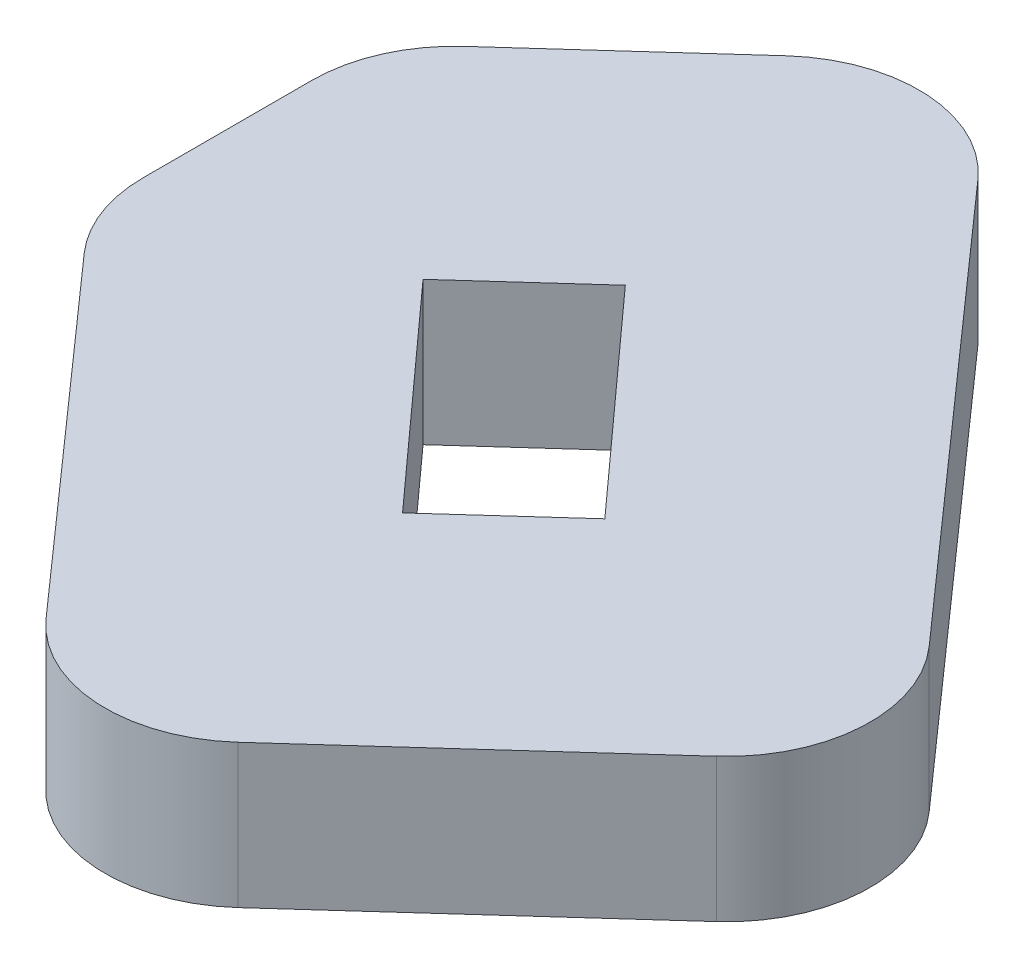
ISO-10303-21;
HEADER;
FILE_DESCRIPTION(('STEP AP214'),'2;1');
FILE_NAME('part.step','',(''),(''),'','','');
FILE_SCHEMA(('AUTOMOTIVE_DESIGN { 1 0 10303 214 1 1 1 1 }'));
ENDSEC;
DATA;
#1=APPLICATION_CONTEXT('core data for automotive mechanical design processes');
#2=APPLICATION_PROTOCOL_DEFINITION('international standard','automotive_design',2000,#1);
#3=PRODUCT_CONTEXT('',#1,'mechanical');
#4=PRODUCT('Part','Part','',(#3));
#5=PRODUCT_RELATED_PRODUCT_CATEGORY('part','',(#4));
#6=PRODUCT_DEFINITION_FORMATION('','',#4);
#7=PRODUCT_DEFINITION_CONTEXT('part definition',#1,'design');
#8=PRODUCT_DEFINITION('design','',#6,#7);
#9=PRODUCT_DEFINITION_SHAPE('','',#8);
#10=(LENGTH_UNIT() NAMED_UNIT(*) SI_UNIT(.MILLI.,.METRE.));
#11=(NAMED_UNIT(*) PLANE_ANGLE_UNIT() SI_UNIT($,.RADIAN.));
#12=(NAMED_UNIT(*) SI_UNIT($,.STERADIAN.) SOLID_ANGLE_UNIT());
#13=UNCERTAINTY_MEASURE_WITH_UNIT(LENGTH_MEASURE(1.E-05),#10,'distance_accuracy_value','');
#14=(GEOMETRIC_REPRESENTATION_CONTEXT(3) GLOBAL_UNCERTAINTY_ASSIGNED_CONTEXT((#13)) GLOBAL_UNIT_ASSIGNED_CONTEXT((#10,
#11,#12)) REPRESENTATION_CONTEXT('',''));
#15=CARTESIAN_POINT('',(0.,0.,0.));
#16=DIRECTION('',(0.,0.,1.));
#17=DIRECTION('',(1.,0.,0.));
#18=AXIS2_PLACEMENT_3D('',#15,#16,#17);
#19=CARTESIAN_POINT('',(0.,0.,0.));
#20=DIRECTION('',(0.,1.,0.));
#21=DIRECTION('',(0.,0.,1.));
#22=AXIS2_PLACEMENT_3D('',#19,#20,#21);
#23=PLANE('',#22);
#24=DIRECTION('',(0.741997771412981,0.,-0.670402347264812));
#25=VECTOR('',#24,1.);
#26=CARTESIAN_POINT('',(-134.548077407903,0.,-58.5644233707118));
#27=LINE('',#26,#25);
#28=CARTESIAN_POINT('',(-136.90392033214,0.,-56.435895918146));
#29=VERTEX_POINT('',#28);
#30=CARTESIAN_POINT('',(-134.548077407903,0.,-58.5644233707118));
#31=VERTEX_POINT('',#30);
#32=EDGE_CURVE('E136',#29,#31,#27,.T.);
#33=ORIENTED_EDGE('',*,*,#32,.T.);
#34=DIRECTION('',(0.670402347264813,0.,0.74199777141298));
#35=VECTOR('',#34,1.);
#36=CARTESIAN_POINT('',(-130.291022502772,0.,-53.8527375222393));
#37=LINE('',#36,#35);
#38=CARTESIAN_POINT('',(-130.291022502772,0.,-53.8527375222393));
#39=VERTEX_POINT('',#38);
#40=EDGE_CURVE('E145',#31,#39,#37,.T.);
#41=ORIENTED_EDGE('',*,*,#40,.T.);
#42=DIRECTION('',(-0.741997771412981,0.,0.670402347264812));
#43=VECTOR('',#42,1.);
#44=CARTESIAN_POINT('',(-132.646865427008,0.,-51.7242100696736));
#45=LINE('',#44,#43);
#46=CARTESIAN_POINT('',(-132.646865427008,0.,-51.7242100696736));
#47=VERTEX_POINT('',#46);
#48=EDGE_CURVE('E48',#39,#47,#45,.T.);
#49=ORIENTED_EDGE('',*,*,#48,.T.);
#50=DIRECTION('',(-0.670402347264813,0.,-0.74199777141298));
#51=VECTOR('',#50,1.);
#52=CARTESIAN_POINT('',(-136.90392033214,0.,-56.435895918146));
#53=LINE('',#52,#51);
#54=EDGE_CURVE('E142',#47,#29,#53,.T.);
#55=ORIENTED_EDGE('',*,*,#54,.T.);
#56=EDGE_LOOP('',(#33,#41,#49,#55));
#57=FACE_BOUND('',#56,.T.);
#58=DIRECTION('',(0.74199777141298,0.,-0.670402347264814));
#59=VECTOR('',#58,1.);
#60=CARTESIAN_POINT('',(-132.445850386458,0.,-43.3484393677768));
#61=LINE('',#60,#59);
#62=CARTESIAN_POINT('',(-130.06736181069,0.,-45.4974273911521));
#63=VERTEX_POINT('',#62);
#64=CARTESIAN_POINT('',(-124.492221590851,0.,-50.5346218864851));
#65=VERTEX_POINT('',#64);
#66=EDGE_CURVE('E166',#63,#65,#61,.T.);
#67=ORIENTED_EDGE('',*,*,#66,.T.);
#68=CARTESIAN_POINT('',(-126.620749043416,0.,-52.8904648107213));
#69=DIRECTION('',(0.,1.,0.));
#70=DIRECTION('',(0.,0.,1.));
#71=AXIS2_PLACEMENT_3D('',#68,#69,#70);
#72=CIRCLE('',#71,3.175);
#73=CARTESIAN_POINT('',(-124.244651682958,0.,-54.9963580496165));
#74=VERTEX_POINT('',#73);
#75=EDGE_CURVE('E212',#65,#74,#72,.T.);
#76=ORIENTED_EDGE('',*,*,#75,.T.);
#77=DIRECTION('',(0.66327346106935,0.,0.748377121404099));
#78=VECTOR('',#77,1.);
#79=CARTESIAN_POINT('',(-122.15880870831,0.,-52.6428835738676));
#80=LINE('',#79,#78);
#81=CARTESIAN_POINT('',(-132.668031904426,0.,-64.5005300278993));
#82=VERTEX_POINT('',#81);
#83=EDGE_CURVE('E174',#82,#74,#80,.T.);
#84=ORIENTED_EDGE('',*,*,#83,.F.);
#85=CARTESIAN_POINT('',(-135.044129264884,0.,-62.3946367890041));
#86=DIRECTION('',(0.,1.,0.));
#87=DIRECTION('',(0.,0.,1.));
#88=AXIS2_PLACEMENT_3D('',#85,#86,#87);
#89=CIRCLE('',#88,3.175);
#90=CARTESIAN_POINT('',(-137.172656717449,0.,-64.7504797132403));
#91=VERTEX_POINT('',#90);
#92=EDGE_CURVE('E204',#82,#91,#89,.T.);
#93=ORIENTED_EDGE('',*,*,#92,.T.);
#94=DIRECTION('',(0.741997771412981,0.,-0.670402347264812));
#95=VECTOR('',#94,1.);
#96=CARTESIAN_POINT('',(-134.794168141681,0.,-66.8994677366157));
#97=LINE('',#96,#95);
#98=CARTESIAN_POINT('',(-140.909458083925,0.,-61.3742426086774));
#99=VERTEX_POINT('',#98);
#100=EDGE_CURVE('E189',#99,#91,#97,.T.);
#101=ORIENTED_EDGE('',*,*,#100,.F.);
#102=CARTESIAN_POINT('',(-138.780930631359,0.,-59.0183996844412));
#103=DIRECTION('',(0.,1.,0.));
#104=DIRECTION('',(0.,0.,1.));
#105=AXIS2_PLACEMENT_3D('',#102,#103,#104);
#106=CIRCLE('',#105,3.175);
#107=CARTESIAN_POINT('',(-141.955930631359,0.,-59.0183996844412));
#108=VERTEX_POINT('',#107);
#109=EDGE_CURVE('E206',#99,#108,#106,.T.);
#110=ORIENTED_EDGE('',*,*,#109,.T.);
#111=DIRECTION('',(0.,0.,-1.));
#112=VECTOR('',#111,1.);
#113=CARTESIAN_POINT('',(-141.955930631359,0.,-54.0787442808157));
#114=LINE('',#113,#112);
#115=CARTESIAN_POINT('',(-141.955930631359,0.,-55.2832288357291));
#116=VERTEX_POINT('',#115);
#117=EDGE_CURVE('E192',#116,#108,#114,.T.);
#118=ORIENTED_EDGE('',*,*,#117,.F.);
#119=CARTESIAN_POINT('',(-138.780930631359,0.,-55.2832288357291));
#120=DIRECTION('',(0.,1.,0.));
#121=DIRECTION('',(0.,0.,1.));
#122=AXIS2_PLACEMENT_3D('',#119,#120,#121);
#123=CIRCLE('',#122,3.175);
#124=CARTESIAN_POINT('',(-141.157027991817,0.,-53.1773355968339));
#125=VERTEX_POINT('',#124);
#126=EDGE_CURVE('E208',#116,#125,#123,.T.);
#127=ORIENTED_EDGE('',*,*,#126,.T.);
#128=DIRECTION('',(0.66327346106935,0.,0.748377121404099));
#129=VECTOR('',#128,1.);
#130=CARTESIAN_POINT('',(-126.870494556782,0.,-37.0577176797877));
#131=LINE('',#130,#129);
#132=CARTESIAN_POINT('',(-134.571986623714,0.,-45.7473770764932));
#133=VERTEX_POINT('',#132);
#134=EDGE_CURVE('E195',#125,#133,#131,.T.);
#135=ORIENTED_EDGE('',*,*,#134,.T.);
#136=CARTESIAN_POINT('',(-132.195889263256,0.,-47.8532703153883));
#137=DIRECTION('',(0.,1.,0.));
#138=DIRECTION('',(0.,0.,1.));
#139=AXIS2_PLACEMENT_3D('',#136,#137,#138);
#140=CIRCLE('',#139,3.175);
#141=EDGE_CURVE('E210',#133,#63,#140,.T.);
#142=ORIENTED_EDGE('',*,*,#141,.T.);
#143=EDGE_LOOP('',(#67,#76,#84,#93,#101,#110,#118,#127,#135,#142));
#144=FACE_BOUND('',#143,.T.);
#145=ADVANCED_FACE('F33',(#57,#144),#23,.T.);
#146=CARTESIAN_POINT('',(-141.955930631359,0.,-54.0787442808157));
#147=DIRECTION('',(-1.,0.,0.));
#148=DIRECTION('',(0.,0.,1.));
#149=AXIS2_PLACEMENT_3D('',#146,#147,#148);
#150=PLANE('',#149);
#151=DIRECTION('',(0.,0.,-1.));
#152=VECTOR('',#151,1.);
#153=CARTESIAN_POINT('',(-141.955930631359,-3.175,-54.0787442808157));
#154=LINE('',#153,#152);
#155=CARTESIAN_POINT('',(-141.955930631359,-3.175,-55.2832288357291));
#156=VERTEX_POINT('',#155);
#157=CARTESIAN_POINT('',(-141.955930631359,-3.175,-59.0183996844412));
#158=VERTEX_POINT('',#157);
#159=EDGE_CURVE('E183',#156,#158,#154,.T.);
#160=ORIENTED_EDGE('',*,*,#159,.F.);
#161=DIRECTION('',(0.,1.,0.));
#162=VECTOR('',#161,1.);
#163=CARTESIAN_POINT('',(-141.955930631359,0.,-55.2832288357291));
#164=LINE('',#163,#162);
#165=EDGE_CURVE('E236',#156,#116,#164,.T.);
#166=ORIENTED_EDGE('',*,*,#165,.T.);
#167=ORIENTED_EDGE('',*,*,#117,.T.);
#168=DIRECTION('',(0.,1.,0.));
#169=VECTOR('',#168,1.);
#170=CARTESIAN_POINT('',(-141.955930631359,0.,-59.0183996844412));
#171=LINE('',#170,#169);
#172=EDGE_CURVE('E234',#108,#158,#171,.F.);
#173=ORIENTED_EDGE('',*,*,#172,.T.);
#174=EDGE_LOOP('',(#160,#166,#167,#173));
#175=FACE_BOUND('',#174,.T.);
#176=ADVANCED_FACE('F280',(#175),#150,.T.);
#177=CARTESIAN_POINT('',(-134.794168141681,0.,-66.8994677366157));
#178=DIRECTION('',(-0.670402347264812,0.,-0.741997771412981));
#179=DIRECTION('',(-0.741997771412981,0.,0.670402347264812));
#180=AXIS2_PLACEMENT_3D('',#177,#178,#179);
#181=PLANE('',#180);
#182=DIRECTION('',(-0.741997771412981,0.,0.670402347264812));
#183=VECTOR('',#182,1.);
#184=CARTESIAN_POINT('',(-134.794168141681,-3.175,-66.8994677366157));
#185=LINE('',#184,#183);
#186=CARTESIAN_POINT('',(-137.172656717449,-3.175,-64.7504797132403));
#187=VERTEX_POINT('',#186);
#188=CARTESIAN_POINT('',(-140.909458083925,-3.175,-61.3742426086774));
#189=VERTEX_POINT('',#188);
#190=EDGE_CURVE('E180',#187,#189,#185,.T.);
#191=ORIENTED_EDGE('',*,*,#190,.T.);
#192=DIRECTION('',(0.,1.,0.));
#193=VECTOR('',#192,1.);
#194=CARTESIAN_POINT('',(-140.909458083925,0.,-61.3742426086774));
#195=LINE('',#194,#193);
#196=EDGE_CURVE('E11',#189,#99,#195,.T.);
#197=ORIENTED_EDGE('',*,*,#196,.T.);
#198=ORIENTED_EDGE('',*,*,#100,.T.);
#199=DIRECTION('',(0.,1.,0.));
#200=VECTOR('',#199,1.);
#201=CARTESIAN_POINT('',(-137.172656717449,0.,-64.7504797132403));
#202=LINE('',#201,#200);
#203=EDGE_CURVE('E41',#91,#187,#202,.F.);
#204=ORIENTED_EDGE('',*,*,#203,.T.);
#205=EDGE_LOOP('',(#191,#197,#198,#204));
#206=FACE_BOUND('',#205,.T.);
#207=ADVANCED_FACE('F241',(#206),#181,.T.);
#208=CARTESIAN_POINT('',(-122.15880870831,0.,-52.6428835738676));
#209=DIRECTION('',(0.748377121404099,0.,-0.66327346106935));
#210=DIRECTION('',(-0.66327346106935,0.,-0.748377121404099));
#211=AXIS2_PLACEMENT_3D('',#208,#209,#210);
#212=PLANE('',#211);
#213=ORIENTED_EDGE('',*,*,#83,.T.);
#214=DIRECTION('',(0.,1.,0.));
#215=VECTOR('',#214,1.);
#216=CARTESIAN_POINT('',(-124.244651682958,0.,-54.9963580496165));
#217=LINE('',#216,#215);
#218=CARTESIAN_POINT('',(-124.244651682958,-3.175,-54.9963580496165));
#219=VERTEX_POINT('',#218);
#220=EDGE_CURVE('E217',#74,#219,#217,.F.);
#221=ORIENTED_EDGE('',*,*,#220,.T.);
#222=DIRECTION('',(-0.66327346106935,0.,-0.748377121404099));
#223=VECTOR('',#222,1.);
#224=CARTESIAN_POINT('',(-122.15880870831,-3.175,-52.6428835738676));
#225=LINE('',#224,#223);
#226=CARTESIAN_POINT('',(-132.668031904426,-3.175,-64.5005300278993));
#227=VERTEX_POINT('',#226);
#228=EDGE_CURVE('E177',#219,#227,#225,.T.);
#229=ORIENTED_EDGE('',*,*,#228,.T.);
#230=DIRECTION('',(0.,1.,0.));
#231=VECTOR('',#230,1.);
#232=CARTESIAN_POINT('',(-132.668031904426,0.,-64.5005300278993));
#233=LINE('',#232,#231);
#234=EDGE_CURVE('E214',#227,#82,#233,.T.);
#235=ORIENTED_EDGE('',*,*,#234,.T.);
#236=EDGE_LOOP('',(#213,#221,#229,#235));
#237=FACE_BOUND('',#236,.T.);
#238=ADVANCED_FACE('F253',(#237),#212,.T.);
#239=CARTESIAN_POINT('',(0.,-3.175,0.));
#240=DIRECTION('',(0.,1.,0.));
#241=DIRECTION('',(0.,0.,1.));
#242=AXIS2_PLACEMENT_3D('',#239,#240,#241);
#243=PLANE('',#242);
#244=DIRECTION('',(0.670402347264813,0.,0.74199777141298));
#245=VECTOR('',#244,1.);
#246=CARTESIAN_POINT('',(-130.291022502772,-3.175,-53.8527375222393));
#247=LINE('',#246,#245);
#248=CARTESIAN_POINT('',(-134.548077407903,-3.175,-58.5644233707117));
#249=VERTEX_POINT('',#248);
#250=CARTESIAN_POINT('',(-130.291022502772,-3.175,-53.8527375222393));
#251=VERTEX_POINT('',#250);
#252=EDGE_CURVE('E160',#249,#251,#247,.T.);
#253=ORIENTED_EDGE('',*,*,#252,.F.);
#254=DIRECTION('',(0.741997771412981,0.,-0.670402347264812));
#255=VECTOR('',#254,1.);
#256=CARTESIAN_POINT('',(-134.548077407903,-3.175,-58.5644233707118));
#257=LINE('',#256,#255);
#258=CARTESIAN_POINT('',(-136.90392033214,-3.175,-56.435895918146));
#259=VERTEX_POINT('',#258);
#260=EDGE_CURVE('E56',#259,#249,#257,.T.);
#261=ORIENTED_EDGE('',*,*,#260,.F.);
#262=DIRECTION('',(-0.670402347264813,0.,-0.74199777141298));
#263=VECTOR('',#262,1.);
#264=CARTESIAN_POINT('',(-136.90392033214,-3.175,-56.435895918146));
#265=LINE('',#264,#263);
#266=CARTESIAN_POINT('',(-132.646865427008,-3.175,-51.7242100696736));
#267=VERTEX_POINT('',#266);
#268=EDGE_CURVE('E151',#267,#259,#265,.T.);
#269=ORIENTED_EDGE('',*,*,#268,.F.);
#270=DIRECTION('',(-0.741997771412981,0.,0.670402347264812));
#271=VECTOR('',#270,1.);
#272=CARTESIAN_POINT('',(-132.646865427008,-3.175,-51.7242100696736));
#273=LINE('',#272,#271);
#274=EDGE_CURVE('E154',#251,#267,#273,.T.);
#275=ORIENTED_EDGE('',*,*,#274,.F.);
#276=EDGE_LOOP('',(#253,#261,#269,#275));
#277=FACE_BOUND('',#276,.T.);
#278=ORIENTED_EDGE('',*,*,#228,.F.);
#279=CARTESIAN_POINT('',(-126.620749043416,-3.175,-52.8904648107213));
#280=DIRECTION('',(0.,1.,0.));
#281=DIRECTION('',(0.,0.,1.));
#282=AXIS2_PLACEMENT_3D('',#279,#280,#281);
#283=CIRCLE('',#282,3.175);
#284=CARTESIAN_POINT('',(-124.492221590851,-3.175,-50.5346218864851));
#285=VERTEX_POINT('',#284);
#286=EDGE_CURVE('E227',#219,#285,#283,.F.);
#287=ORIENTED_EDGE('',*,*,#286,.T.);
#288=DIRECTION('',(0.74199777141298,0.,-0.670402347264814));
#289=VECTOR('',#288,1.);
#290=CARTESIAN_POINT('',(-132.445850386458,-3.175,-43.3484393677768));
#291=LINE('',#290,#289);
#292=CARTESIAN_POINT('',(-130.06736181069,-3.175,-45.4974273911521));
#293=VERTEX_POINT('',#292);
#294=EDGE_CURVE('E173',#293,#285,#291,.T.);
#295=ORIENTED_EDGE('',*,*,#294,.F.);
#296=CARTESIAN_POINT('',(-132.195889263256,-3.175,-47.8532703153883));
#297=DIRECTION('',(0.,1.,0.));
#298=DIRECTION('',(0.,0.,1.));
#299=AXIS2_PLACEMENT_3D('',#296,#297,#298);
#300=CIRCLE('',#299,3.175);
#301=CARTESIAN_POINT('',(-134.571986623714,-3.175,-45.7473770764932));
#302=VERTEX_POINT('',#301);
#303=EDGE_CURVE('E225',#293,#302,#300,.F.);
#304=ORIENTED_EDGE('',*,*,#303,.T.);
#305=DIRECTION('',(0.663273461069351,0.,0.748377121404098));
#306=VECTOR('',#305,1.);
#307=CARTESIAN_POINT('',(-141.955930631359,-3.175,-54.0787442808157));
#308=LINE('',#307,#306);
#309=CARTESIAN_POINT('',(-141.157027991817,-3.175,-53.1773355968339));
#310=VERTEX_POINT('',#309);
#311=EDGE_CURVE('E170',#310,#302,#308,.T.);
#312=ORIENTED_EDGE('',*,*,#311,.F.);
#313=CARTESIAN_POINT('',(-138.780930631359,-3.175,-55.2832288357291));
#314=DIRECTION('',(0.,1.,0.));
#315=DIRECTION('',(0.,0.,1.));
#316=AXIS2_PLACEMENT_3D('',#313,#314,#315);
#317=CIRCLE('',#316,3.175);
#318=EDGE_CURVE('E223',#310,#156,#317,.F.);
#319=ORIENTED_EDGE('',*,*,#318,.T.);
#320=ORIENTED_EDGE('',*,*,#159,.T.);
#321=CARTESIAN_POINT('',(-138.780930631359,-3.175,-59.0183996844412));
#322=DIRECTION('',(0.,1.,0.));
#323=DIRECTION('',(0.,0.,1.));
#324=AXIS2_PLACEMENT_3D('',#321,#322,#323);
#325=CIRCLE('',#324,3.175);
#326=EDGE_CURVE('E221',#158,#189,#325,.F.);
#327=ORIENTED_EDGE('',*,*,#326,.T.);
#328=ORIENTED_EDGE('',*,*,#190,.F.);
#329=CARTESIAN_POINT('',(-135.044129264884,-3.175,-62.3946367890041));
#330=DIRECTION('',(0.,1.,0.));
#331=DIRECTION('',(0.,0.,1.));
#332=AXIS2_PLACEMENT_3D('',#329,#330,#331);
#333=CIRCLE('',#332,3.175);
#334=EDGE_CURVE('E219',#187,#227,#333,.F.);
#335=ORIENTED_EDGE('',*,*,#334,.T.);
#336=EDGE_LOOP('',(#278,#287,#295,#304,#312,#319,#320,#327,#328,#335));
#337=FACE_BOUND('',#336,.T.);
#338=ADVANCED_FACE('F248',(#277,#337),#243,.F.);
#339=CARTESIAN_POINT('',(-126.870494556782,3.175,-37.0577176797877));
#340=DIRECTION('',(0.748377121404099,0.,-0.66327346106935));
#341=DIRECTION('',(-0.66327346106935,0.,-0.748377121404099));
#342=AXIS2_PLACEMENT_3D('',#339,#340,#341);
#343=PLANE('',#342);
#344=ORIENTED_EDGE('',*,*,#311,.T.);
#345=DIRECTION('',(0.,1.,0.));
#346=VECTOR('',#345,1.);
#347=CARTESIAN_POINT('',(-134.571986623714,0.,-45.7473770764932));
#348=LINE('',#347,#346);
#349=EDGE_CURVE('E231',#302,#133,#348,.T.);
#350=ORIENTED_EDGE('',*,*,#349,.T.);
#351=ORIENTED_EDGE('',*,*,#134,.F.);
#352=DIRECTION('',(0.,1.,0.));
#353=VECTOR('',#352,1.);
#354=CARTESIAN_POINT('',(-141.157027991817,-3.175,-53.1773355968339));
#355=LINE('',#354,#353);
#356=EDGE_CURVE('E229',#125,#310,#355,.F.);
#357=ORIENTED_EDGE('',*,*,#356,.T.);
#358=EDGE_LOOP('',(#344,#350,#351,#357));
#359=FACE_BOUND('',#358,.T.);
#360=ADVANCED_FACE('F271',(#359),#343,.F.);
#361=CARTESIAN_POINT('',(-132.445850386458,-3.175,-43.3484393677768));
#362=DIRECTION('',(0.670402347264813,0.,0.74199777141298));
#363=DIRECTION('',(0.74199777141298,0.,-0.670402347264814));
#364=AXIS2_PLACEMENT_3D('',#361,#362,#363);
#365=PLANE('',#364);
#366=ORIENTED_EDGE('',*,*,#294,.T.);
#367=DIRECTION('',(0.,1.,0.));
#368=VECTOR('',#367,1.);
#369=CARTESIAN_POINT('',(-124.492221590851,-3.175,-50.5346218864851));
#370=LINE('',#369,#368);
#371=EDGE_CURVE('E201',#285,#65,#370,.T.);
#372=ORIENTED_EDGE('',*,*,#371,.T.);
#373=ORIENTED_EDGE('',*,*,#66,.F.);
#374=DIRECTION('',(0.,1.,0.));
#375=VECTOR('',#374,1.);
#376=CARTESIAN_POINT('',(-130.06736181069,-3.175,-45.4974273911521));
#377=LINE('',#376,#375);
#378=EDGE_CURVE('E186',#63,#293,#377,.F.);
#379=ORIENTED_EDGE('',*,*,#378,.T.);
#380=EDGE_LOOP('',(#366,#372,#373,#379));
#381=FACE_BOUND('',#380,.T.);
#382=ADVANCED_FACE('F261',(#381),#365,.T.);
#383=CARTESIAN_POINT('',(-126.620749043416,-3.175,-52.8904648107213));
#384=DIRECTION('',(0.,1.,0.));
#385=DIRECTION('',(0.,0.,1.));
#386=AXIS2_PLACEMENT_3D('',#383,#384,#385);
#387=CYLINDRICAL_SURFACE('',#386,3.175);
#388=ORIENTED_EDGE('',*,*,#286,.F.);
#389=ORIENTED_EDGE('',*,*,#220,.F.);
#390=ORIENTED_EDGE('',*,*,#75,.F.);
#391=ORIENTED_EDGE('',*,*,#371,.F.);
#392=EDGE_LOOP('',(#388,#389,#390,#391));
#393=FACE_BOUND('',#392,.T.);
#394=ADVANCED_FACE('F259',(#393),#387,.T.);
#395=CARTESIAN_POINT('',(-132.195889263256,3.175,-47.8532703153883));
#396=DIRECTION('',(0.,-1.,0.));
#397=DIRECTION('',(0.,0.,-1.));
#398=AXIS2_PLACEMENT_3D('',#395,#396,#397);
#399=CYLINDRICAL_SURFACE('',#398,3.175);
#400=ORIENTED_EDGE('',*,*,#303,.F.);
#401=ORIENTED_EDGE('',*,*,#378,.F.);
#402=ORIENTED_EDGE('',*,*,#141,.F.);
#403=ORIENTED_EDGE('',*,*,#349,.F.);
#404=EDGE_LOOP('',(#400,#401,#402,#403));
#405=FACE_BOUND('',#404,.T.);
#406=ADVANCED_FACE('F268',(#405),#399,.T.);
#407=CARTESIAN_POINT('',(-138.780930631359,0.,-55.2832288357291));
#408=DIRECTION('',(0.,-1.,0.));
#409=DIRECTION('',(0.,0.,-1.));
#410=AXIS2_PLACEMENT_3D('',#407,#408,#409);
#411=CYLINDRICAL_SURFACE('',#410,3.175);
#412=ORIENTED_EDGE('',*,*,#318,.F.);
#413=ORIENTED_EDGE('',*,*,#356,.F.);
#414=ORIENTED_EDGE('',*,*,#126,.F.);
#415=ORIENTED_EDGE('',*,*,#165,.F.);
#416=EDGE_LOOP('',(#412,#413,#414,#415));
#417=FACE_BOUND('',#416,.T.);
#418=ADVANCED_FACE('F277',(#417),#411,.T.);
#419=CARTESIAN_POINT('',(-138.780930631359,0.,-59.0183996844412));
#420=DIRECTION('',(0.,1.,0.));
#421=DIRECTION('',(0.,0.,1.));
#422=AXIS2_PLACEMENT_3D('',#419,#420,#421);
#423=CYLINDRICAL_SURFACE('',#422,3.175);
#424=ORIENTED_EDGE('',*,*,#326,.F.);
#425=ORIENTED_EDGE('',*,*,#172,.F.);
#426=ORIENTED_EDGE('',*,*,#109,.F.);
#427=ORIENTED_EDGE('',*,*,#196,.F.);
#428=EDGE_LOOP('',(#424,#425,#426,#427));
#429=FACE_BOUND('',#428,.T.);
#430=ADVANCED_FACE('F283',(#429),#423,.T.);
#431=CARTESIAN_POINT('',(-135.044129264884,0.,-62.3946367890041));
#432=DIRECTION('',(0.,1.,0.));
#433=DIRECTION('',(0.,0.,1.));
#434=AXIS2_PLACEMENT_3D('',#431,#432,#433);
#435=CYLINDRICAL_SURFACE('',#434,3.175);
#436=ORIENTED_EDGE('',*,*,#334,.F.);
#437=ORIENTED_EDGE('',*,*,#203,.F.);
#438=ORIENTED_EDGE('',*,*,#92,.F.);
#439=ORIENTED_EDGE('',*,*,#234,.F.);
#440=EDGE_LOOP('',(#436,#437,#438,#439));
#441=FACE_BOUND('',#440,.T.);
#442=ADVANCED_FACE('F35',(#441),#435,.T.);
#443=CARTESIAN_POINT('',(-134.548077407903,0.,-58.5644233707118));
#444=DIRECTION('',(-0.670402347264812,0.,-0.741997771412981));
#445=DIRECTION('',(-0.741997771412981,0.,0.670402347264812));
#446=AXIS2_PLACEMENT_3D('',#443,#444,#445);
#447=PLANE('',#446);
#448=ORIENTED_EDGE('',*,*,#260,.T.);
#449=DIRECTION('',(0.,-1.,0.));
#450=VECTOR('',#449,1.);
#451=CARTESIAN_POINT('',(-134.548077407903,0.,-58.5644233707118));
#452=LINE('',#451,#450);
#453=EDGE_CURVE('E132',#31,#249,#452,.T.);
#454=ORIENTED_EDGE('',*,*,#453,.F.);
#455=ORIENTED_EDGE('',*,*,#32,.F.);
#456=DIRECTION('',(0.,-1.,0.));
#457=VECTOR('',#456,1.);
#458=CARTESIAN_POINT('',(-136.90392033214,0.,-56.435895918146));
#459=LINE('',#458,#457);
#460=EDGE_CURVE('E164',#29,#259,#459,.T.);
#461=ORIENTED_EDGE('',*,*,#460,.T.);
#462=EDGE_LOOP('',(#448,#454,#455,#461));
#463=FACE_BOUND('',#462,.T.);
#464=ADVANCED_FACE('F134',(#463),#447,.F.);
#465=CARTESIAN_POINT('',(-136.90392033214,0.,-56.435895918146));
#466=DIRECTION('',(-0.74199777141298,0.,0.670402347264813));
#467=DIRECTION('',(0.670402347264813,0.,0.74199777141298));
#468=AXIS2_PLACEMENT_3D('',#465,#466,#467);
#469=PLANE('',#468);
#470=ORIENTED_EDGE('',*,*,#268,.T.);
#471=ORIENTED_EDGE('',*,*,#460,.F.);
#472=ORIENTED_EDGE('',*,*,#54,.F.);
#473=DIRECTION('',(0.,-1.,0.));
#474=VECTOR('',#473,1.);
#475=CARTESIAN_POINT('',(-132.646865427008,0.,-51.7242100696736));
#476=LINE('',#475,#474);
#477=EDGE_CURVE('E167',#47,#267,#476,.T.);
#478=ORIENTED_EDGE('',*,*,#477,.T.);
#479=EDGE_LOOP('',(#470,#471,#472,#478));
#480=FACE_BOUND('',#479,.T.);
#481=ADVANCED_FACE('F346',(#480),#469,.F.);
#482=CARTESIAN_POINT('',(-132.646865427008,0.,-51.7242100696736));
#483=DIRECTION('',(0.670402347264812,0.,0.741997771412981));
#484=DIRECTION('',(0.741997771412981,0.,-0.670402347264812));
#485=AXIS2_PLACEMENT_3D('',#482,#483,#484);
#486=PLANE('',#485);
#487=ORIENTED_EDGE('',*,*,#274,.T.);
#488=ORIENTED_EDGE('',*,*,#477,.F.);
#489=ORIENTED_EDGE('',*,*,#48,.F.);
#490=DIRECTION('',(0.,-1.,0.));
#491=VECTOR('',#490,1.);
#492=CARTESIAN_POINT('',(-130.291022502772,0.,-53.8527375222393));
#493=LINE('',#492,#491);
#494=EDGE_CURVE('E141',#39,#251,#493,.T.);
#495=ORIENTED_EDGE('',*,*,#494,.T.);
#496=EDGE_LOOP('',(#487,#488,#489,#495));
#497=FACE_BOUND('',#496,.T.);
#498=ADVANCED_FACE('F355',(#497),#486,.F.);
#499=CARTESIAN_POINT('',(-130.291022502772,0.,-53.8527375222393));
#500=DIRECTION('',(0.74199777141298,0.,-0.670402347264813));
#501=DIRECTION('',(-0.670402347264813,0.,-0.74199777141298));
#502=AXIS2_PLACEMENT_3D('',#499,#500,#501);
#503=PLANE('',#502);
#504=ORIENTED_EDGE('',*,*,#252,.T.);
#505=ORIENTED_EDGE('',*,*,#494,.F.);
#506=ORIENTED_EDGE('',*,*,#40,.F.);
#507=ORIENTED_EDGE('',*,*,#453,.T.);
#508=EDGE_LOOP('',(#504,#505,#506,#507));
#509=FACE_BOUND('',#508,.T.);
#510=ADVANCED_FACE('F146',(#509),#503,.F.);
#511=CLOSED_SHELL('',(#145,#176,#207,#238,#338,#360,#382,#394,#406,#418,#430,#442,#464,#481,
#498,#510));
#512=MANIFOLD_SOLID_BREP('B2',#511);
#513=ADVANCED_BREP_SHAPE_REPRESENTATION('',(#18,#512),#14);
#514=SHAPE_DEFINITION_REPRESENTATION(#9,#513);
ENDSEC;
END-ISO-10303-21;
